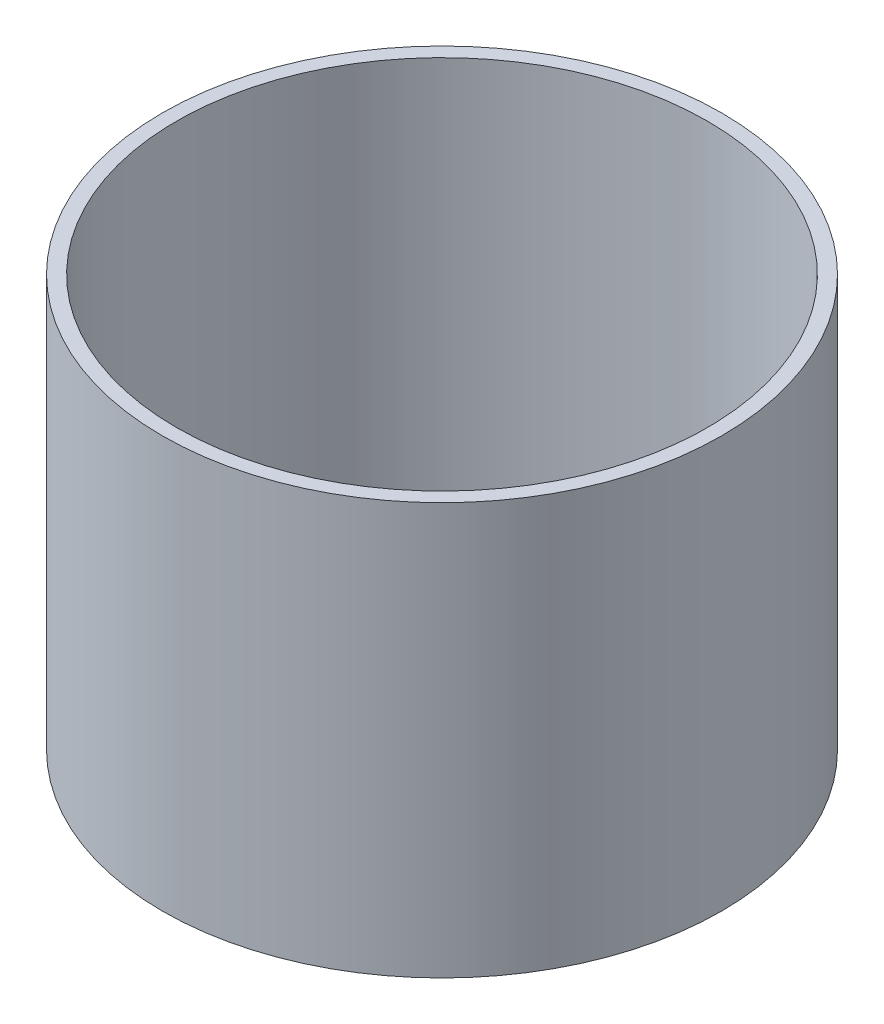
ISO-10303-21;
HEADER;
FILE_DESCRIPTION(('STEP AP214'),'2;1');
FILE_NAME('part.step','',(''),(''),'','','');
FILE_SCHEMA(('AUTOMOTIVE_DESIGN { 1 0 10303 214 1 1 1 1 }'));
ENDSEC;
DATA;
#1=APPLICATION_CONTEXT('core data for automotive mechanical design processes');
#2=APPLICATION_PROTOCOL_DEFINITION('international standard','automotive_design',2000,#1);
#3=PRODUCT_CONTEXT('',#1,'mechanical');
#4=PRODUCT('Part','Part','',(#3));
#5=PRODUCT_RELATED_PRODUCT_CATEGORY('part','',(#4));
#6=PRODUCT_DEFINITION_FORMATION('','',#4);
#7=PRODUCT_DEFINITION_CONTEXT('part definition',#1,'design');
#8=PRODUCT_DEFINITION('design','',#6,#7);
#9=PRODUCT_DEFINITION_SHAPE('','',#8);
#10=(LENGTH_UNIT() NAMED_UNIT(*) SI_UNIT(.MILLI.,.METRE.));
#11=(NAMED_UNIT(*) PLANE_ANGLE_UNIT() SI_UNIT($,.RADIAN.));
#12=(NAMED_UNIT(*) SI_UNIT($,.STERADIAN.) SOLID_ANGLE_UNIT());
#13=UNCERTAINTY_MEASURE_WITH_UNIT(LENGTH_MEASURE(1.E-05),#10,'distance_accuracy_value','');
#14=(GEOMETRIC_REPRESENTATION_CONTEXT(3) GLOBAL_UNCERTAINTY_ASSIGNED_CONTEXT((#13)) GLOBAL_UNIT_ASSIGNED_CONTEXT((#10,
#11,#12)) REPRESENTATION_CONTEXT('',''));
#15=CARTESIAN_POINT('',(0.,0.,0.));
#16=DIRECTION('',(0.,0.,1.));
#17=DIRECTION('',(1.,0.,0.));
#18=AXIS2_PLACEMENT_3D('',#15,#16,#17);
#19=CARTESIAN_POINT('',(0.,68.92544,0.));
#20=DIRECTION('',(0.,1.,0.));
#21=DIRECTION('',(0.,0.,1.));
#22=AXIS2_PLACEMENT_3D('',#19,#20,#21);
#23=PLANE('',#22);
#24=CARTESIAN_POINT('',(0.,68.92544,0.));
#25=DIRECTION('',(0.,1.,0.));
#26=DIRECTION('',(0.,0.,1.));
#27=AXIS2_PLACEMENT_3D('',#24,#25,#26);
#28=CIRCLE('',#27,93.6625);
#29=CARTESIAN_POINT('',(0.,68.92544,93.6625));
#30=VERTEX_POINT('',#29);
#31=EDGE_CURVE('E10',#30,#30,#28,.T.);
#32=ORIENTED_EDGE('',*,*,#31,.T.);
#33=EDGE_LOOP('',(#32));
#34=FACE_BOUND('',#33,.T.);
#35=CARTESIAN_POINT('',(0.,68.92544,0.));
#36=DIRECTION('',(0.,1.,0.));
#37=DIRECTION('',(0.,0.,1.));
#38=AXIS2_PLACEMENT_3D('',#35,#36,#37);
#39=CIRCLE('',#38,88.9);
#40=CARTESIAN_POINT('',(0.,68.92544,88.9));
#41=VERTEX_POINT('',#40);
#42=EDGE_CURVE('E46',#41,#41,#39,.T.);
#43=ORIENTED_EDGE('',*,*,#42,.F.);
#44=EDGE_LOOP('',(#43));
#45=FACE_BOUND('',#44,.T.);
#46=ADVANCED_FACE('F35',(#34,#45),#23,.T.);
#47=CARTESIAN_POINT('',(0.,-68.92544,0.));
#48=DIRECTION('',(0.,1.,0.));
#49=DIRECTION('',(0.,0.,1.));
#50=AXIS2_PLACEMENT_3D('',#47,#48,#49);
#51=PLANE('',#50);
#52=CARTESIAN_POINT('',(0.,-68.92544,0.));
#53=DIRECTION('',(0.,1.,0.));
#54=DIRECTION('',(0.,0.,1.));
#55=AXIS2_PLACEMENT_3D('',#52,#53,#54);
#56=CIRCLE('',#55,93.6625);
#57=CARTESIAN_POINT('',(0.,-68.92544,93.6625));
#58=VERTEX_POINT('',#57);
#59=EDGE_CURVE('E39',#58,#58,#56,.T.);
#60=ORIENTED_EDGE('',*,*,#59,.F.);
#61=EDGE_LOOP('',(#60));
#62=FACE_BOUND('',#61,.T.);
#63=CARTESIAN_POINT('',(0.,-68.92544,0.));
#64=DIRECTION('',(0.,1.,0.));
#65=DIRECTION('',(0.,0.,1.));
#66=AXIS2_PLACEMENT_3D('',#63,#64,#65);
#67=CIRCLE('',#66,88.9);
#68=CARTESIAN_POINT('',(0.,-68.92544,88.9));
#69=VERTEX_POINT('',#68);
#70=EDGE_CURVE('E48',#69,#69,#67,.T.);
#71=ORIENTED_EDGE('',*,*,#70,.T.);
#72=EDGE_LOOP('',(#71));
#73=FACE_BOUND('',#72,.T.);
#74=ADVANCED_FACE('F58',(#62,#73),#51,.F.);
#75=CARTESIAN_POINT('',(0.,68.92544,0.));
#76=DIRECTION('',(0.,-1.,0.));
#77=DIRECTION('',(0.,0.,-1.));
#78=AXIS2_PLACEMENT_3D('',#75,#76,#77);
#79=CYLINDRICAL_SURFACE('',#78,93.6625);
#80=ORIENTED_EDGE('',*,*,#31,.F.);
#81=EDGE_LOOP('',(#80));
#82=FACE_BOUND('',#81,.T.);
#83=ORIENTED_EDGE('',*,*,#59,.T.);
#84=EDGE_LOOP('',(#83));
#85=FACE_BOUND('',#84,.T.);
#86=ADVANCED_FACE('F37',(#82,#85),#79,.T.);
#87=CARTESIAN_POINT('',(0.,68.92544,0.));
#88=DIRECTION('',(0.,-1.,0.));
#89=DIRECTION('',(0.,0.,-1.));
#90=AXIS2_PLACEMENT_3D('',#87,#88,#89);
#91=CYLINDRICAL_SURFACE('',#90,88.9);
#92=ORIENTED_EDGE('',*,*,#42,.T.);
#93=EDGE_LOOP('',(#92));
#94=FACE_BOUND('',#93,.T.);
#95=ORIENTED_EDGE('',*,*,#70,.F.);
#96=EDGE_LOOP('',(#95));
#97=FACE_BOUND('',#96,.T.);
#98=ADVANCED_FACE('F54',(#94,#97),#91,.F.);
#99=CLOSED_SHELL('',(#46,#74,#86,#98));
#100=MANIFOLD_SOLID_BREP('B2',#99);
#101=ADVANCED_BREP_SHAPE_REPRESENTATION('',(#18,#100),#14);
#102=SHAPE_DEFINITION_REPRESENTATION(#9,#101);
ENDSEC;
END-ISO-10303-21;
